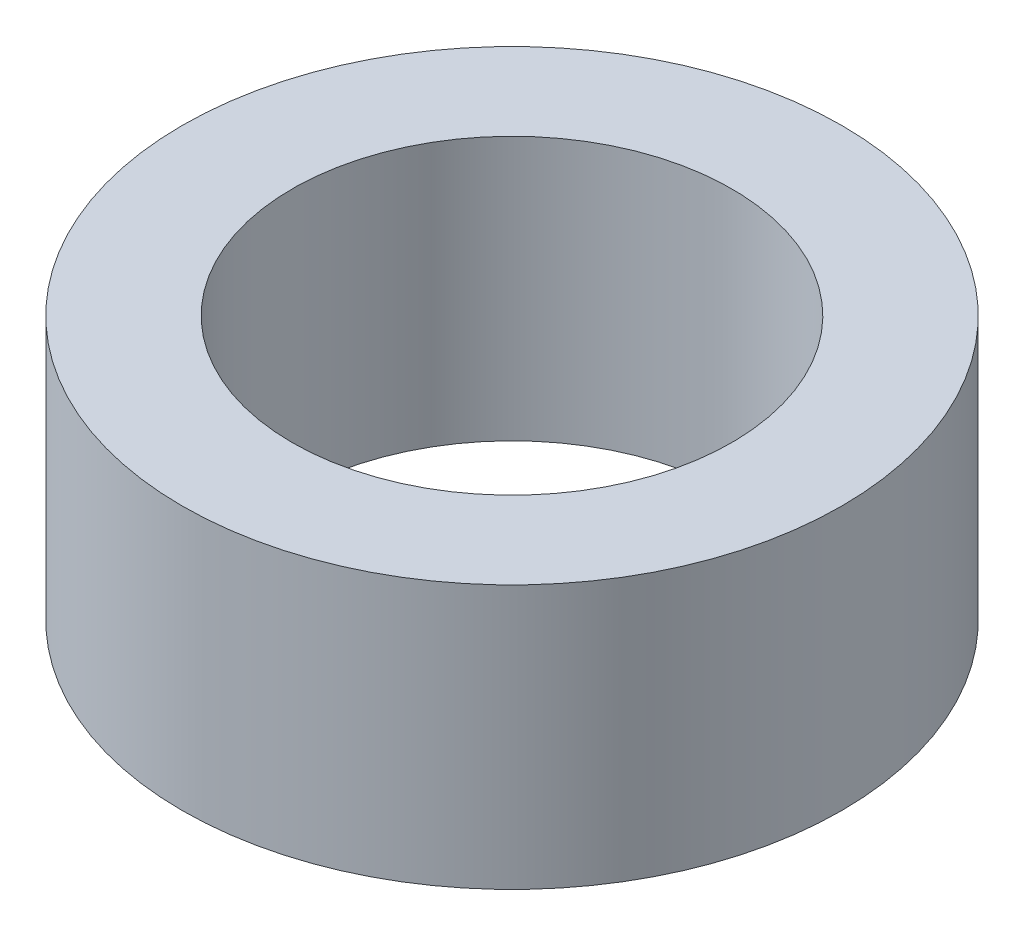
ISO-10303-21;
HEADER;
FILE_DESCRIPTION(('STEP AP214'),'2;1');
FILE_NAME('part.step','',(''),(''),'','','');
FILE_SCHEMA(('AUTOMOTIVE_DESIGN { 1 0 10303 214 1 1 1 1 }'));
ENDSEC;
DATA;
#1=APPLICATION_CONTEXT('core data for automotive mechanical design processes');
#2=APPLICATION_PROTOCOL_DEFINITION('international standard','automotive_design',2000,#1);
#3=PRODUCT_CONTEXT('',#1,'mechanical');
#4=PRODUCT('Part','Part','',(#3));
#5=PRODUCT_RELATED_PRODUCT_CATEGORY('part','',(#4));
#6=PRODUCT_DEFINITION_FORMATION('','',#4);
#7=PRODUCT_DEFINITION_CONTEXT('part definition',#1,'design');
#8=PRODUCT_DEFINITION('design','',#6,#7);
#9=PRODUCT_DEFINITION_SHAPE('','',#8);
#10=(LENGTH_UNIT() NAMED_UNIT(*) SI_UNIT(.MILLI.,.METRE.));
#11=(NAMED_UNIT(*) PLANE_ANGLE_UNIT() SI_UNIT($,.RADIAN.));
#12=(NAMED_UNIT(*) SI_UNIT($,.STERADIAN.) SOLID_ANGLE_UNIT());
#13=UNCERTAINTY_MEASURE_WITH_UNIT(LENGTH_MEASURE(1.E-05),#10,'distance_accuracy_value','');
#14=(GEOMETRIC_REPRESENTATION_CONTEXT(3) GLOBAL_UNCERTAINTY_ASSIGNED_CONTEXT((#13)) GLOBAL_UNIT_ASSIGNED_CONTEXT((#10,
#11,#12)) REPRESENTATION_CONTEXT('',''));
#15=CARTESIAN_POINT('',(0.,0.,0.));
#16=DIRECTION('',(0.,0.,1.));
#17=DIRECTION('',(1.,0.,0.));
#18=AXIS2_PLACEMENT_3D('',#15,#16,#17);
#19=CARTESIAN_POINT('',(0.,18.,0.));
#20=DIRECTION('',(0.,-1.,0.));
#21=DIRECTION('',(0.,0.,-1.));
#22=AXIS2_PLACEMENT_3D('',#19,#20,#21);
#23=CYLINDRICAL_SURFACE('',#22,22.5);
#24=CARTESIAN_POINT('',(0.,18.,0.));
#25=DIRECTION('',(0.,1.,0.));
#26=DIRECTION('',(0.,0.,1.));
#27=AXIS2_PLACEMENT_3D('',#24,#25,#26);
#28=CIRCLE('',#27,22.5);
#29=CARTESIAN_POINT('',(0.,18.,22.5));
#30=VERTEX_POINT('',#29);
#31=EDGE_CURVE('E10',#30,#30,#28,.T.);
#32=ORIENTED_EDGE('',*,*,#31,.F.);
#33=EDGE_LOOP('',(#32));
#34=FACE_BOUND('',#33,.T.);
#35=CARTESIAN_POINT('',(0.,0.,0.));
#36=DIRECTION('',(0.,1.,0.));
#37=DIRECTION('',(0.,0.,1.));
#38=AXIS2_PLACEMENT_3D('',#35,#36,#37);
#39=CIRCLE('',#38,22.5);
#40=CARTESIAN_POINT('',(0.,0.,22.5));
#41=VERTEX_POINT('',#40);
#42=EDGE_CURVE('E37',#41,#41,#39,.T.);
#43=ORIENTED_EDGE('',*,*,#42,.T.);
#44=EDGE_LOOP('',(#43));
#45=FACE_BOUND('',#44,.T.);
#46=ADVANCED_FACE('F40',(#34,#45),#23,.T.);
#47=CARTESIAN_POINT('',(0.,18.,0.));
#48=DIRECTION('',(0.,1.,0.));
#49=DIRECTION('',(0.,0.,1.));
#50=AXIS2_PLACEMENT_3D('',#47,#48,#49);
#51=PLANE('',#50);
#52=CARTESIAN_POINT('',(0.,18.,0.));
#53=DIRECTION('',(0.,1.,0.));
#54=DIRECTION('',(0.,0.,1.));
#55=AXIS2_PLACEMENT_3D('',#52,#53,#54);
#56=CIRCLE('',#55,15.);
#57=CARTESIAN_POINT('',(0.,18.,15.));
#58=VERTEX_POINT('',#57);
#59=EDGE_CURVE('E50',#58,#58,#56,.T.);
#60=ORIENTED_EDGE('',*,*,#59,.F.);
#61=EDGE_LOOP('',(#60));
#62=FACE_BOUND('',#61,.T.);
#63=ORIENTED_EDGE('',*,*,#31,.T.);
#64=EDGE_LOOP('',(#63));
#65=FACE_BOUND('',#64,.T.);
#66=ADVANCED_FACE('F59',(#62,#65),#51,.T.);
#67=CARTESIAN_POINT('',(0.,0.,0.));
#68=DIRECTION('',(0.,1.,0.));
#69=DIRECTION('',(0.,0.,1.));
#70=AXIS2_PLACEMENT_3D('',#67,#68,#69);
#71=PLANE('',#70);
#72=CARTESIAN_POINT('',(0.,0.,0.));
#73=DIRECTION('',(0.,1.,0.));
#74=DIRECTION('',(0.,0.,1.));
#75=AXIS2_PLACEMENT_3D('',#72,#73,#74);
#76=CIRCLE('',#75,15.);
#77=CARTESIAN_POINT('',(0.,0.,15.));
#78=VERTEX_POINT('',#77);
#79=EDGE_CURVE('E47',#78,#78,#76,.T.);
#80=ORIENTED_EDGE('',*,*,#79,.T.);
#81=EDGE_LOOP('',(#80));
#82=FACE_BOUND('',#81,.T.);
#83=ORIENTED_EDGE('',*,*,#42,.F.);
#84=EDGE_LOOP('',(#83));
#85=FACE_BOUND('',#84,.T.);
#86=ADVANCED_FACE('F58',(#82,#85),#71,.F.);
#87=CARTESIAN_POINT('',(0.,18.,0.));
#88=DIRECTION('',(0.,-1.,0.));
#89=DIRECTION('',(0.,0.,-1.));
#90=AXIS2_PLACEMENT_3D('',#87,#88,#89);
#91=CYLINDRICAL_SURFACE('',#90,15.);
#92=ORIENTED_EDGE('',*,*,#59,.T.);
#93=EDGE_LOOP('',(#92));
#94=FACE_BOUND('',#93,.T.);
#95=ORIENTED_EDGE('',*,*,#79,.F.);
#96=EDGE_LOOP('',(#95));
#97=FACE_BOUND('',#96,.T.);
#98=ADVANCED_FACE('F54',(#94,#97),#91,.F.);
#99=CLOSED_SHELL('',(#46,#66,#86,#98));
#100=MANIFOLD_SOLID_BREP('B2',#99);
#101=ADVANCED_BREP_SHAPE_REPRESENTATION('',(#18,#100),#14);
#102=SHAPE_DEFINITION_REPRESENTATION(#9,#101);
ENDSEC;
END-ISO-10303-21;
